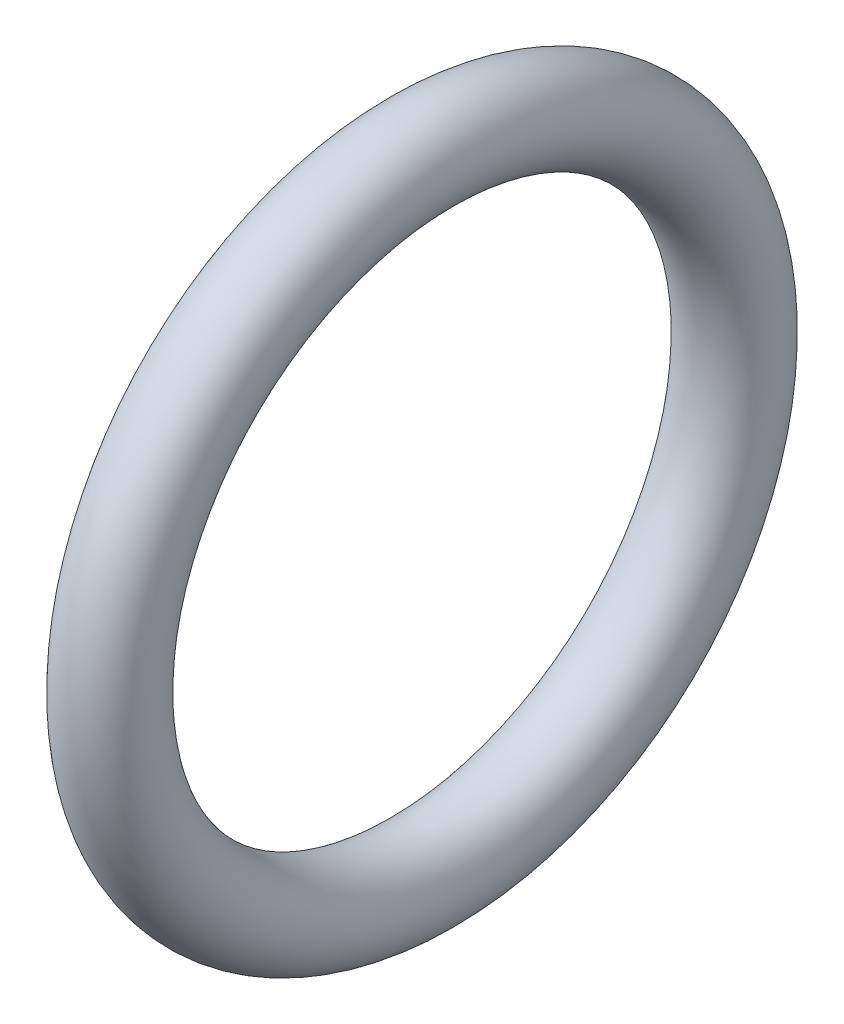
ISO-10303-21;
HEADER;
FILE_DESCRIPTION(('STEP AP214'),'2;1');
FILE_NAME('part.step','',(''),(''),'','','');
FILE_SCHEMA(('AUTOMOTIVE_DESIGN { 1 0 10303 214 1 1 1 1 }'));
ENDSEC;
DATA;
#1=APPLICATION_CONTEXT('core data for automotive mechanical design processes');
#2=APPLICATION_PROTOCOL_DEFINITION('international standard','automotive_design',2000,#1);
#3=PRODUCT_CONTEXT('',#1,'mechanical');
#4=PRODUCT('Part','Part','',(#3));
#5=PRODUCT_RELATED_PRODUCT_CATEGORY('part','',(#4));
#6=PRODUCT_DEFINITION_FORMATION('','',#4);
#7=PRODUCT_DEFINITION_CONTEXT('part definition',#1,'design');
#8=PRODUCT_DEFINITION('design','',#6,#7);
#9=PRODUCT_DEFINITION_SHAPE('','',#8);
#10=(LENGTH_UNIT() NAMED_UNIT(*) SI_UNIT(.MILLI.,.METRE.));
#11=(NAMED_UNIT(*) PLANE_ANGLE_UNIT() SI_UNIT($,.RADIAN.));
#12=(NAMED_UNIT(*) SI_UNIT($,.STERADIAN.) SOLID_ANGLE_UNIT());
#13=UNCERTAINTY_MEASURE_WITH_UNIT(LENGTH_MEASURE(1.E-05),#10,'distance_accuracy_value','');
#14=(GEOMETRIC_REPRESENTATION_CONTEXT(3) GLOBAL_UNCERTAINTY_ASSIGNED_CONTEXT((#13)) GLOBAL_UNIT_ASSIGNED_CONTEXT((#10,
#11,#12)) REPRESENTATION_CONTEXT('',''));
#15=CARTESIAN_POINT('',(0.,0.,0.));
#16=DIRECTION('',(0.,0.,1.));
#17=DIRECTION('',(1.,0.,0.));
#18=AXIS2_PLACEMENT_3D('',#15,#16,#17);
#19=CARTESIAN_POINT('',(5.5,0.,0.));
#20=DIRECTION('',(1.,0.,0.));
#21=DIRECTION('',(0.,-1.,0.));
#22=AXIS2_PLACEMENT_3D('',#19,#20,#21);
#23=TOROIDAL_SURFACE('',#22,19.25,2.75);
#24=CARTESIAN_POINT('',(5.5,-22.,0.));
#25=VERTEX_POINT('',#24);
#26=VERTEX_LOOP('',#25);
#27=FACE_BOUND('',#26,.T.);
#28=ADVANCED_FACE('F12',(#27),#23,.T.);
#29=CLOSED_SHELL('',(#28));
#30=MANIFOLD_SOLID_BREP('B1',#29);
#31=ADVANCED_BREP_SHAPE_REPRESENTATION('',(#18,#30),#14);
#32=SHAPE_DEFINITION_REPRESENTATION(#9,#31);
ENDSEC;
END-ISO-10303-21;
